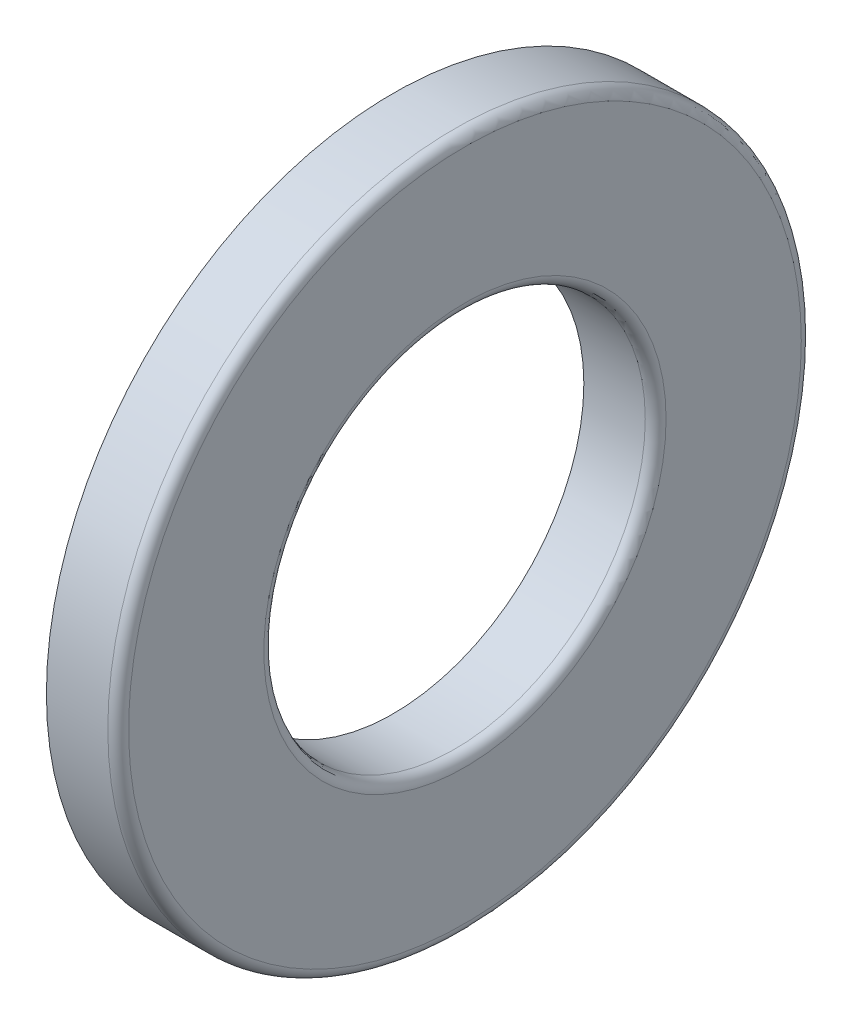
ISO-10303-21;
HEADER;
FILE_DESCRIPTION(('STEP AP214'),'2;1');
FILE_NAME('part.step','',(''),(''),'','','');
FILE_SCHEMA(('AUTOMOTIVE_DESIGN { 1 0 10303 214 1 1 1 1 }'));
ENDSEC;
DATA;
#1=APPLICATION_CONTEXT('core data for automotive mechanical design processes');
#2=APPLICATION_PROTOCOL_DEFINITION('international standard','automotive_design',2000,#1);
#3=PRODUCT_CONTEXT('',#1,'mechanical');
#4=PRODUCT('Part','Part','',(#3));
#5=PRODUCT_RELATED_PRODUCT_CATEGORY('part','',(#4));
#6=PRODUCT_DEFINITION_FORMATION('','',#4);
#7=PRODUCT_DEFINITION_CONTEXT('part definition',#1,'design');
#8=PRODUCT_DEFINITION('design','',#6,#7);
#9=PRODUCT_DEFINITION_SHAPE('','',#8);
#10=(LENGTH_UNIT() NAMED_UNIT(*) SI_UNIT(.MILLI.,.METRE.));
#11=(NAMED_UNIT(*) PLANE_ANGLE_UNIT() SI_UNIT($,.RADIAN.));
#12=(NAMED_UNIT(*) SI_UNIT($,.STERADIAN.) SOLID_ANGLE_UNIT());
#13=UNCERTAINTY_MEASURE_WITH_UNIT(LENGTH_MEASURE(1.E-05),#10,'distance_accuracy_value','');
#14=(GEOMETRIC_REPRESENTATION_CONTEXT(3) GLOBAL_UNCERTAINTY_ASSIGNED_CONTEXT((#13)) GLOBAL_UNIT_ASSIGNED_CONTEXT((#10,
#11,#12)) REPRESENTATION_CONTEXT('',''));
#15=CARTESIAN_POINT('',(0.,0.,0.));
#16=DIRECTION('',(0.,0.,1.));
#17=DIRECTION('',(1.,0.,0.));
#18=AXIS2_PLACEMENT_3D('',#15,#16,#17);
#19=CARTESIAN_POINT('',(9.858,12.857333437046,0.));
#20=DIRECTION('',(-1.,0.,0.));
#21=DIRECTION('',(0.,0.,1.));
#22=AXIS2_PLACEMENT_3D('',#19,#20,#21);
#23=PLANE('',#22);
#24=CARTESIAN_POINT('',(9.858,0.,0.));
#25=DIRECTION('',(1.,0.,0.));
#26=DIRECTION('',(0.,0.,-1.));
#27=AXIS2_PLACEMENT_3D('',#24,#25,#26);
#28=CIRCLE('',#27,11.);
#29=CARTESIAN_POINT('',(9.858,0.,-11.));
#30=VERTEX_POINT('',#29);
#31=EDGE_CURVE('E10',#30,#30,#28,.T.);
#32=ORIENTED_EDGE('',*,*,#31,.T.);
#33=EDGE_LOOP('',(#32));
#34=FACE_BOUND('',#33,.T.);
#35=CARTESIAN_POINT('',(9.858,0.,0.));
#36=DIRECTION('',(1.,0.,0.));
#37=DIRECTION('',(0.,0.,-1.));
#38=AXIS2_PLACEMENT_3D('',#35,#36,#37);
#39=CIRCLE('',#38,12.857333437046);
#40=CARTESIAN_POINT('',(9.858,0.,-12.857333437046));
#41=VERTEX_POINT('',#40);
#42=EDGE_CURVE('E57',#41,#41,#39,.T.);
#43=ORIENTED_EDGE('',*,*,#42,.F.);
#44=EDGE_LOOP('',(#43));
#45=FACE_BOUND('',#44,.T.);
#46=ADVANCED_FACE('F29',(#34,#45),#23,.T.);
#47=CARTESIAN_POINT('',(13.4,0.,0.));
#48=DIRECTION('',(1.,0.,0.));
#49=DIRECTION('',(0.,0.,-1.));
#50=AXIS2_PLACEMENT_3D('',#47,#48,#49);
#51=CYLINDRICAL_SURFACE('',#50,11.);
#52=CARTESIAN_POINT('',(13.4,0.,0.));
#53=DIRECTION('',(1.,0.,0.));
#54=DIRECTION('',(0.,0.,-1.));
#55=AXIS2_PLACEMENT_3D('',#52,#53,#54);
#56=CIRCLE('',#55,11.);
#57=CARTESIAN_POINT('',(13.4,0.,-11.));
#58=VERTEX_POINT('',#57);
#59=EDGE_CURVE('E35',#58,#58,#56,.T.);
#60=ORIENTED_EDGE('',*,*,#59,.T.);
#61=EDGE_LOOP('',(#60));
#62=FACE_BOUND('',#61,.T.);
#63=ORIENTED_EDGE('',*,*,#31,.F.);
#64=EDGE_LOOP('',(#63));
#65=FACE_BOUND('',#64,.T.);
#66=ADVANCED_FACE('F65',(#62,#65),#51,.F.);
#67=CARTESIAN_POINT('',(13.4000000000002,0.,0.));
#68=DIRECTION('',(1.,0.,0.));
#69=DIRECTION('',(0.,0.,-1.));
#70=AXIS2_PLACEMENT_3D('',#67,#68,#69);
#71=TOROIDAL_SURFACE('',#70,11.5999999999998,0.599999999999761);
#72=CARTESIAN_POINT('',(14.,0.,0.));
#73=DIRECTION('',(1.,0.,0.));
#74=DIRECTION('',(0.,0.,-1.));
#75=AXIS2_PLACEMENT_3D('',#72,#73,#74);
#76=CIRCLE('',#75,11.6);
#77=CARTESIAN_POINT('',(14.,0.,-11.6));
#78=VERTEX_POINT('',#77);
#79=EDGE_CURVE('E39',#78,#78,#76,.T.);
#80=ORIENTED_EDGE('',*,*,#79,.T.);
#81=EDGE_LOOP('',(#80));
#82=FACE_BOUND('',#81,.T.);
#83=ORIENTED_EDGE('',*,*,#59,.F.);
#84=EDGE_LOOP('',(#83));
#85=FACE_BOUND('',#84,.T.);
#86=ADVANCED_FACE('F69',(#82,#85),#71,.T.);
#87=CARTESIAN_POINT('',(14.,11.6,0.));
#88=DIRECTION('',(1.,0.,0.));
#89=DIRECTION('',(0.,0.,-1.));
#90=AXIS2_PLACEMENT_3D('',#87,#88,#89);
#91=PLANE('',#90);
#92=CARTESIAN_POINT('',(14.,0.,0.));
#93=DIRECTION('',(1.,0.,0.));
#94=DIRECTION('',(0.,0.,-1.));
#95=AXIS2_PLACEMENT_3D('',#92,#93,#94);
#96=CIRCLE('',#95,19.4);
#97=CARTESIAN_POINT('',(14.,0.,-19.4));
#98=VERTEX_POINT('',#97);
#99=EDGE_CURVE('E43',#98,#98,#96,.T.);
#100=ORIENTED_EDGE('',*,*,#99,.T.);
#101=EDGE_LOOP('',(#100));
#102=FACE_BOUND('',#101,.T.);
#103=ORIENTED_EDGE('',*,*,#79,.F.);
#104=EDGE_LOOP('',(#103));
#105=FACE_BOUND('',#104,.T.);
#106=ADVANCED_FACE('F73',(#102,#105),#91,.T.);
#107=CARTESIAN_POINT('',(13.4000000000002,0.,0.));
#108=DIRECTION('',(1.,0.,0.));
#109=DIRECTION('',(0.,0.,-1.));
#110=AXIS2_PLACEMENT_3D('',#107,#108,#109);
#111=TOROIDAL_SURFACE('',#110,19.4000000000002,0.599999999999758);
#112=CARTESIAN_POINT('',(13.4,0.,0.));
#113=DIRECTION('',(1.,0.,0.));
#114=DIRECTION('',(0.,0.,-1.));
#115=AXIS2_PLACEMENT_3D('',#112,#113,#114);
#116=CIRCLE('',#115,20.);
#117=CARTESIAN_POINT('',(13.4,0.,-20.));
#118=VERTEX_POINT('',#117);
#119=EDGE_CURVE('E48',#118,#118,#116,.T.);
#120=ORIENTED_EDGE('',*,*,#119,.T.);
#121=EDGE_LOOP('',(#120));
#122=FACE_BOUND('',#121,.T.);
#123=ORIENTED_EDGE('',*,*,#99,.F.);
#124=EDGE_LOOP('',(#123));
#125=FACE_BOUND('',#124,.T.);
#126=ADVANCED_FACE('F80',(#122,#125),#111,.T.);
#127=CARTESIAN_POINT('',(13.4,0.,0.));
#128=DIRECTION('',(1.,0.,0.));
#129=DIRECTION('',(0.,0.,-1.));
#130=AXIS2_PLACEMENT_3D('',#127,#128,#129);
#131=CYLINDRICAL_SURFACE('',#130,20.);
#132=CARTESIAN_POINT('',(9.858,0.,0.));
#133=DIRECTION('',(1.,0.,0.));
#134=DIRECTION('',(0.,0.,-1.));
#135=AXIS2_PLACEMENT_3D('',#132,#133,#134);
#136=CIRCLE('',#135,20.);
#137=CARTESIAN_POINT('',(9.858,0.,-20.));
#138=VERTEX_POINT('',#137);
#139=EDGE_CURVE('E51',#138,#138,#136,.T.);
#140=ORIENTED_EDGE('',*,*,#139,.T.);
#141=EDGE_LOOP('',(#140));
#142=FACE_BOUND('',#141,.T.);
#143=ORIENTED_EDGE('',*,*,#119,.F.);
#144=EDGE_LOOP('',(#143));
#145=FACE_BOUND('',#144,.T.);
#146=ADVANCED_FACE('F84',(#142,#145),#131,.T.);
#147=CARTESIAN_POINT('',(9.858,20.,0.));
#148=DIRECTION('',(-1.,0.,0.));
#149=DIRECTION('',(0.,0.,1.));
#150=AXIS2_PLACEMENT_3D('',#147,#148,#149);
#151=PLANE('',#150);
#152=CARTESIAN_POINT('',(9.858,0.,0.));
#153=DIRECTION('',(1.,0.,0.));
#154=DIRECTION('',(0.,0.,-1.));
#155=AXIS2_PLACEMENT_3D('',#152,#153,#154);
#156=CIRCLE('',#155,17.142666562954);
#157=CARTESIAN_POINT('',(9.858,0.,-17.142666562954));
#158=VERTEX_POINT('',#157);
#159=EDGE_CURVE('E54',#158,#158,#156,.T.);
#160=ORIENTED_EDGE('',*,*,#159,.T.);
#161=EDGE_LOOP('',(#160));
#162=FACE_BOUND('',#161,.T.);
#163=ORIENTED_EDGE('',*,*,#139,.F.);
#164=EDGE_LOOP('',(#163));
#165=FACE_BOUND('',#164,.T.);
#166=ADVANCED_FACE('F88',(#162,#165),#151,.T.);
#167=CARTESIAN_POINT('',(6.99999999999921,0.,0.));
#168=DIRECTION('',(1.,0.,0.));
#169=DIRECTION('',(0.,0.,-1.));
#170=AXIS2_PLACEMENT_3D('',#167,#168,#169);
#171=TOROIDAL_SURFACE('',#170,15.,3.57200000000079);
#172=ORIENTED_EDGE('',*,*,#42,.T.);
#173=EDGE_LOOP('',(#172));
#174=FACE_BOUND('',#173,.T.);
#175=ORIENTED_EDGE('',*,*,#159,.F.);
#176=EDGE_LOOP('',(#175));
#177=FACE_BOUND('',#176,.T.);
#178=ADVANCED_FACE('F61',(#174,#177),#171,.F.);
#179=CLOSED_SHELL('',(#46,#66,#86,#106,#126,#146,#166,#178));
#180=MANIFOLD_SOLID_BREP('B2',#179);
#181=ADVANCED_BREP_SHAPE_REPRESENTATION('',(#18,#180),#14);
#182=SHAPE_DEFINITION_REPRESENTATION(#9,#181);
ENDSEC;
END-ISO-10303-21;
